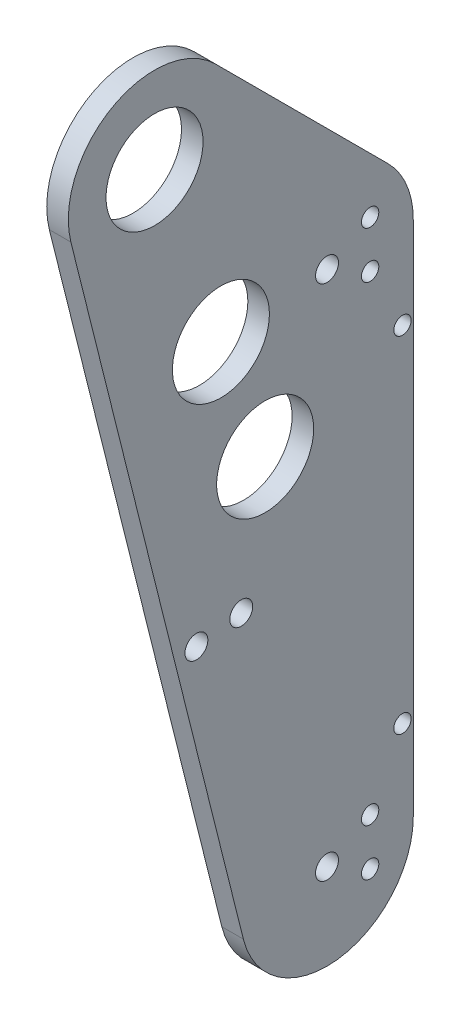
ISO-10303-21;
HEADER;
FILE_DESCRIPTION(('STEP AP214'),'2;1');
FILE_NAME('part.step','',(''),(''),'','','');
FILE_SCHEMA(('AUTOMOTIVE_DESIGN { 1 0 10303 214 1 1 1 1 }'));
ENDSEC;
DATA;
#1=APPLICATION_CONTEXT('core data for automotive mechanical design processes');
#2=APPLICATION_PROTOCOL_DEFINITION('international standard','automotive_design',2000,#1);
#3=PRODUCT_CONTEXT('',#1,'mechanical');
#4=PRODUCT('Part','Part','',(#3));
#5=PRODUCT_RELATED_PRODUCT_CATEGORY('part','',(#4));
#6=PRODUCT_DEFINITION_FORMATION('','',#4);
#7=PRODUCT_DEFINITION_CONTEXT('part definition',#1,'design');
#8=PRODUCT_DEFINITION('design','',#6,#7);
#9=PRODUCT_DEFINITION_SHAPE('','',#8);
#10=(LENGTH_UNIT() NAMED_UNIT(*) SI_UNIT(.MILLI.,.METRE.));
#11=(NAMED_UNIT(*) PLANE_ANGLE_UNIT() SI_UNIT($,.RADIAN.));
#12=(NAMED_UNIT(*) SI_UNIT($,.STERADIAN.) SOLID_ANGLE_UNIT());
#13=UNCERTAINTY_MEASURE_WITH_UNIT(LENGTH_MEASURE(1.E-05),#10,'distance_accuracy_value','');
#14=(GEOMETRIC_REPRESENTATION_CONTEXT(3) GLOBAL_UNCERTAINTY_ASSIGNED_CONTEXT((#13)) GLOBAL_UNIT_ASSIGNED_CONTEXT((#10,
#11,#12)) REPRESENTATION_CONTEXT('',''));
#15=CARTESIAN_POINT('',(0.,0.,0.));
#16=DIRECTION('',(0.,0.,1.));
#17=DIRECTION('',(1.,0.,0.));
#18=AXIS2_PLACEMENT_3D('',#15,#16,#17);
#19=CARTESIAN_POINT('',(6.35,0.,0.));
#20=DIRECTION('',(-1.,0.,0.));
#21=DIRECTION('',(0.,0.,1.));
#22=AXIS2_PLACEMENT_3D('',#19,#20,#21);
#23=CYLINDRICAL_SURFACE('',#22,25.4);
#24=CARTESIAN_POINT('',(0.,0.,0.));
#25=DIRECTION('',(1.,0.,0.));
#26=DIRECTION('',(0.,0.,-1.));
#27=AXIS2_PLACEMENT_3D('',#24,#25,#26);
#28=CIRCLE('',#27,25.4);
#29=CARTESIAN_POINT('',(0.,17.9605122421383,-17.9605122421383));
#30=VERTEX_POINT('',#29);
#31=CARTESIAN_POINT('',(0.,-6.16040487592286,24.6416195036914));
#32=VERTEX_POINT('',#31);
#33=EDGE_CURVE('E122',#30,#32,#28,.T.);
#34=ORIENTED_EDGE('',*,*,#33,.T.);
#35=DIRECTION('',(-1.,0.,0.));
#36=VECTOR('',#35,1.);
#37=CARTESIAN_POINT('',(6.35,-6.16040487592286,24.6416195036914));
#38=LINE('',#37,#36);
#39=CARTESIAN_POINT('',(6.35,-6.16040487592286,24.6416195036914));
#40=VERTEX_POINT('',#39);
#41=EDGE_CURVE('E11',#40,#32,#38,.T.);
#42=ORIENTED_EDGE('',*,*,#41,.F.);
#43=CARTESIAN_POINT('',(6.35,0.,0.));
#44=DIRECTION('',(1.,0.,0.));
#45=DIRECTION('',(0.,0.,-1.));
#46=AXIS2_PLACEMENT_3D('',#43,#44,#45);
#47=CIRCLE('',#46,25.4);
#48=CARTESIAN_POINT('',(6.35,17.9605122421383,-17.9605122421383));
#49=VERTEX_POINT('',#48);
#50=EDGE_CURVE('E133',#49,#40,#47,.T.);
#51=ORIENTED_EDGE('',*,*,#50,.F.);
#52=DIRECTION('',(-1.,0.,0.));
#53=VECTOR('',#52,1.);
#54=CARTESIAN_POINT('',(6.35,17.9605122421383,-17.9605122421383));
#55=LINE('',#54,#53);
#56=EDGE_CURVE('E118',#49,#30,#55,.T.);
#57=ORIENTED_EDGE('',*,*,#56,.T.);
#58=EDGE_LOOP('',(#34,#42,#51,#57));
#59=FACE_BOUND('',#58,.T.);
#60=ADVANCED_FACE('F38',(#59),#23,.T.);
#61=CARTESIAN_POINT('',(6.35,-6.16040487592286,24.6416195036914));
#62=DIRECTION('',(0.,0.242535625036333,-0.970142500145332));
#63=DIRECTION('',(0.,0.970142500145332,0.242535625036333));
#64=AXIS2_PLACEMENT_3D('',#61,#62,#63);
#65=PLANE('',#64);
#66=DIRECTION('',(0.,-0.970142500145332,-0.242535625036333));
#67=VECTOR('',#66,1.);
#68=CARTESIAN_POINT('',(0.,-6.16040487592286,24.6416195036914));
#69=LINE('',#68,#67);
#70=CARTESIAN_POINT('',(0.,-209.360404875923,-26.1583804963086));
#71=VERTEX_POINT('',#70);
#72=EDGE_CURVE('E125',#32,#71,#69,.T.);
#73=ORIENTED_EDGE('',*,*,#72,.T.);
#74=DIRECTION('',(-1.,0.,0.));
#75=VECTOR('',#74,1.);
#76=CARTESIAN_POINT('',(6.35,-209.360404875923,-26.1583804963086));
#77=LINE('',#76,#75);
#78=CARTESIAN_POINT('',(6.35,-209.360404875923,-26.1583804963086));
#79=VERTEX_POINT('',#78);
#80=EDGE_CURVE('E46',#79,#71,#77,.T.);
#81=ORIENTED_EDGE('',*,*,#80,.F.);
#82=DIRECTION('',(0.,-0.970142500145332,-0.242535625036333));
#83=VECTOR('',#82,1.);
#84=CARTESIAN_POINT('',(6.35,-6.16040487592286,24.6416195036914));
#85=LINE('',#84,#83);
#86=EDGE_CURVE('E91',#40,#79,#85,.T.);
#87=ORIENTED_EDGE('',*,*,#86,.F.);
#88=ORIENTED_EDGE('',*,*,#41,.T.);
#89=EDGE_LOOP('',(#73,#81,#87,#88));
#90=FACE_BOUND('',#89,.T.);
#91=ADVANCED_FACE('F158',(#90),#65,.F.);
#92=CARTESIAN_POINT('',(6.35,-203.2,-50.8));
#93=DIRECTION('',(-1.,0.,0.));
#94=DIRECTION('',(0.,0.,1.));
#95=AXIS2_PLACEMENT_3D('',#92,#93,#94);
#96=CYLINDRICAL_SURFACE('',#95,25.4);
#97=CARTESIAN_POINT('',(0.,-203.2,-50.8));
#98=DIRECTION('',(1.,0.,0.));
#99=DIRECTION('',(0.,0.,-1.));
#100=AXIS2_PLACEMENT_3D('',#97,#98,#99);
#101=CIRCLE('',#100,25.4);
#102=CARTESIAN_POINT('',(0.,-203.2,-76.2));
#103=VERTEX_POINT('',#102);
#104=EDGE_CURVE('E128',#71,#103,#101,.T.);
#105=ORIENTED_EDGE('',*,*,#104,.T.);
#106=DIRECTION('',(-1.,0.,0.));
#107=VECTOR('',#106,1.);
#108=CARTESIAN_POINT('',(6.35,-203.2,-76.2));
#109=LINE('',#108,#107);
#110=CARTESIAN_POINT('',(6.35,-203.2,-76.2));
#111=VERTEX_POINT('',#110);
#112=EDGE_CURVE('E113',#111,#103,#109,.T.);
#113=ORIENTED_EDGE('',*,*,#112,.F.);
#114=CARTESIAN_POINT('',(6.35,-203.2,-50.8));
#115=DIRECTION('',(1.,0.,0.));
#116=DIRECTION('',(0.,0.,-1.));
#117=AXIS2_PLACEMENT_3D('',#114,#115,#116);
#118=CIRCLE('',#117,25.4);
#119=EDGE_CURVE('E104',#79,#111,#118,.T.);
#120=ORIENTED_EDGE('',*,*,#119,.F.);
#121=ORIENTED_EDGE('',*,*,#80,.T.);
#122=EDGE_LOOP('',(#105,#113,#120,#121));
#123=FACE_BOUND('',#122,.T.);
#124=ADVANCED_FACE('F139',(#123),#96,.T.);
#125=CARTESIAN_POINT('',(6.35,-203.2,-76.2));
#126=DIRECTION('',(0.,0.,1.));
#127=DIRECTION('',(1.,0.,0.));
#128=AXIS2_PLACEMENT_3D('',#125,#126,#127);
#129=PLANE('',#128);
#130=DIRECTION('',(0.,1.,0.));
#131=VECTOR('',#130,1.);
#132=CARTESIAN_POINT('',(0.,-203.2,-76.2));
#133=LINE('',#132,#131);
#134=CARTESIAN_POINT('',(0.,-50.8,-76.2));
#135=VERTEX_POINT('',#134);
#136=EDGE_CURVE('E112',#103,#135,#133,.T.);
#137=ORIENTED_EDGE('',*,*,#136,.T.);
#138=DIRECTION('',(-1.,0.,0.));
#139=VECTOR('',#138,1.);
#140=CARTESIAN_POINT('',(6.35,-50.8,-76.2));
#141=LINE('',#140,#139);
#142=CARTESIAN_POINT('',(6.35,-50.8,-76.2));
#143=VERTEX_POINT('',#142);
#144=EDGE_CURVE('E109',#143,#135,#141,.T.);
#145=ORIENTED_EDGE('',*,*,#144,.F.);
#146=DIRECTION('',(0.,1.,0.));
#147=VECTOR('',#146,1.);
#148=CARTESIAN_POINT('',(6.35,-203.2,-76.2));
#149=LINE('',#148,#147);
#150=EDGE_CURVE('E98',#111,#143,#149,.T.);
#151=ORIENTED_EDGE('',*,*,#150,.F.);
#152=ORIENTED_EDGE('',*,*,#112,.T.);
#153=EDGE_LOOP('',(#137,#145,#151,#152));
#154=FACE_BOUND('',#153,.T.);
#155=ADVANCED_FACE('F110',(#154),#129,.F.);
#156=CARTESIAN_POINT('',(6.35,-50.8,-50.8));
#157=DIRECTION('',(-1.,0.,0.));
#158=DIRECTION('',(0.,0.,1.));
#159=AXIS2_PLACEMENT_3D('',#156,#157,#158);
#160=CYLINDRICAL_SURFACE('',#159,25.4);
#161=CARTESIAN_POINT('',(0.,-50.8,-50.8));
#162=DIRECTION('',(1.,0.,0.));
#163=DIRECTION('',(0.,0.,-1.));
#164=AXIS2_PLACEMENT_3D('',#161,#162,#163);
#165=CIRCLE('',#164,25.4);
#166=CARTESIAN_POINT('',(0.,-32.8394877578617,-68.7605122421383));
#167=VERTEX_POINT('',#166);
#168=EDGE_CURVE('E77',#135,#167,#165,.T.);
#169=ORIENTED_EDGE('',*,*,#168,.T.);
#170=DIRECTION('',(-1.,0.,0.));
#171=VECTOR('',#170,1.);
#172=CARTESIAN_POINT('',(6.35,-32.8394877578617,-68.7605122421383));
#173=LINE('',#172,#171);
#174=CARTESIAN_POINT('',(6.35,-32.8394877578617,-68.7605122421383));
#175=VERTEX_POINT('',#174);
#176=EDGE_CURVE('E114',#175,#167,#173,.T.);
#177=ORIENTED_EDGE('',*,*,#176,.F.);
#178=CARTESIAN_POINT('',(6.35,-50.8,-50.8));
#179=DIRECTION('',(1.,0.,0.));
#180=DIRECTION('',(0.,0.,-1.));
#181=AXIS2_PLACEMENT_3D('',#178,#179,#180);
#182=CIRCLE('',#181,25.4);
#183=EDGE_CURVE('E102',#143,#175,#182,.T.);
#184=ORIENTED_EDGE('',*,*,#183,.F.);
#185=ORIENTED_EDGE('',*,*,#144,.T.);
#186=EDGE_LOOP('',(#169,#177,#184,#185));
#187=FACE_BOUND('',#186,.T.);
#188=ADVANCED_FACE('F116',(#187),#160,.T.);
#189=CARTESIAN_POINT('',(6.35,-32.8394877578617,-68.7605122421383));
#190=DIRECTION('',(0.,-0.707106781186548,0.707106781186547));
#191=DIRECTION('',(0.,-0.707106781186547,-0.707106781186548));
#192=AXIS2_PLACEMENT_3D('',#189,#190,#191);
#193=PLANE('',#192);
#194=DIRECTION('',(0.,0.707106781186547,0.707106781186548));
#195=VECTOR('',#194,1.);
#196=CARTESIAN_POINT('',(0.,-32.8394877578617,-68.7605122421383));
#197=LINE('',#196,#195);
#198=EDGE_CURVE('E83',#167,#30,#197,.T.);
#199=ORIENTED_EDGE('',*,*,#198,.T.);
#200=ORIENTED_EDGE('',*,*,#56,.F.);
#201=DIRECTION('',(0.,0.707106781186547,0.707106781186548));
#202=VECTOR('',#201,1.);
#203=CARTESIAN_POINT('',(6.35,-32.8394877578617,-68.7605122421383));
#204=LINE('',#203,#202);
#205=EDGE_CURVE('E54',#175,#49,#204,.T.);
#206=ORIENTED_EDGE('',*,*,#205,.F.);
#207=ORIENTED_EDGE('',*,*,#176,.T.);
#208=EDGE_LOOP('',(#199,#200,#206,#207));
#209=FACE_BOUND('',#208,.T.);
#210=ADVANCED_FACE('F146',(#209),#193,.F.);
#211=CARTESIAN_POINT('',(6.35,0.,0.));
#212=DIRECTION('',(1.,0.,0.));
#213=DIRECTION('',(0.,0.,-1.));
#214=AXIS2_PLACEMENT_3D('',#211,#212,#213);
#215=PLANE('',#214);
#216=CARTESIAN_POINT('',(6.34999999999999,-76.2,-73.025));
#217=DIRECTION('',(-1.,0.,0.));
#218=DIRECTION('',(0.,0.,1.));
#219=AXIS2_PLACEMENT_3D('',#216,#217,#218);
#220=CIRCLE('',#219,2.55269999999999);
#221=CARTESIAN_POINT('',(6.34999999999999,-76.2,-70.4723));
#222=VERTEX_POINT('',#221);
#223=EDGE_CURVE('E335',#222,#222,#220,.T.);
#224=ORIENTED_EDGE('',*,*,#223,.T.);
#225=EDGE_LOOP('',(#224));
#226=FACE_BOUND('',#225,.T.);
#227=CARTESIAN_POINT('',(6.34999999999999,-177.8,-73.025));
#228=DIRECTION('',(-1.,0.,0.));
#229=DIRECTION('',(0.,0.,1.));
#230=AXIS2_PLACEMENT_3D('',#227,#228,#229);
#231=CIRCLE('',#230,2.55269999999999);
#232=CARTESIAN_POINT('',(6.34999999999999,-177.8,-70.4723));
#233=VERTEX_POINT('',#232);
#234=EDGE_CURVE('E345',#233,#233,#231,.T.);
#235=ORIENTED_EDGE('',*,*,#234,.T.);
#236=EDGE_LOOP('',(#235));
#237=FACE_BOUND('',#236,.T.);
#238=CARTESIAN_POINT('',(6.34999999999999,-125.856446570165,-25.5354137763876));
#239=DIRECTION('',(-1.,0.,0.));
#240=DIRECTION('',(0.,0.,1.));
#241=AXIS2_PLACEMENT_3D('',#238,#239,#240);
#242=CIRCLE('',#241,3.37819999999998);
#243=CARTESIAN_POINT('',(6.34999999999999,-125.856446570165,-22.1572137763876));
#244=VERTEX_POINT('',#243);
#245=EDGE_CURVE('E351',#244,#244,#242,.T.);
#246=ORIENTED_EDGE('',*,*,#245,.T.);
#247=EDGE_LOOP('',(#246));
#248=FACE_BOUND('',#247,.T.);
#249=CARTESIAN_POINT('',(6.35,-57.7088,-63.5));
#250=DIRECTION('',(-1.,0.,0.));
#251=DIRECTION('',(0.,0.,1.));
#252=AXIS2_PLACEMENT_3D('',#249,#250,#251);
#253=CIRCLE('',#252,2.5527);
#254=CARTESIAN_POINT('',(6.35,-57.7088,-60.9473));
#255=VERTEX_POINT('',#254);
#256=EDGE_CURVE('E357',#255,#255,#253,.T.);
#257=ORIENTED_EDGE('',*,*,#256,.T.);
#258=EDGE_LOOP('',(#257));
#259=FACE_BOUND('',#258,.T.);
#260=CARTESIAN_POINT('',(6.35,-43.8912,-63.5));
#261=DIRECTION('',(-1.,0.,0.));
#262=DIRECTION('',(0.,0.,1.));
#263=AXIS2_PLACEMENT_3D('',#260,#261,#262);
#264=CIRCLE('',#263,2.5527);
#265=CARTESIAN_POINT('',(6.35,-43.8912,-60.9473));
#266=VERTEX_POINT('',#265);
#267=EDGE_CURVE('E363',#266,#266,#264,.T.);
#268=ORIENTED_EDGE('',*,*,#267,.T.);
#269=EDGE_LOOP('',(#268));
#270=FACE_BOUND('',#269,.T.);
#271=CARTESIAN_POINT('',(6.35,-210.1088,-63.5));
#272=DIRECTION('',(-1.,0.,0.));
#273=DIRECTION('',(0.,0.,1.));
#274=AXIS2_PLACEMENT_3D('',#271,#272,#273);
#275=CIRCLE('',#274,2.55269999999999);
#276=CARTESIAN_POINT('',(6.35,-210.1088,-60.9473));
#277=VERTEX_POINT('',#276);
#278=EDGE_CURVE('E369',#277,#277,#275,.T.);
#279=ORIENTED_EDGE('',*,*,#278,.T.);
#280=EDGE_LOOP('',(#279));
#281=FACE_BOUND('',#280,.T.);
#282=CARTESIAN_POINT('',(6.35,-196.2912,-63.5));
#283=DIRECTION('',(-1.,0.,0.));
#284=DIRECTION('',(0.,0.,1.));
#285=AXIS2_PLACEMENT_3D('',#282,#283,#284);
#286=CIRCLE('',#285,2.55269999999999);
#287=CARTESIAN_POINT('',(6.35,-196.2912,-60.9473));
#288=VERTEX_POINT('',#287);
#289=EDGE_CURVE('E375',#288,#288,#286,.T.);
#290=ORIENTED_EDGE('',*,*,#289,.T.);
#291=EDGE_LOOP('',(#290));
#292=FACE_BOUND('',#291,.T.);
#293=CARTESIAN_POINT('',(6.35,-50.8,-50.8));
#294=DIRECTION('',(1.,0.,0.));
#295=DIRECTION('',(0.,0.,-1.));
#296=AXIS2_PLACEMENT_3D('',#293,#294,#295);
#297=CIRCLE('',#296,3.37819999999998);
#298=CARTESIAN_POINT('',(6.35,-50.8,-54.1782));
#299=VERTEX_POINT('',#298);
#300=EDGE_CURVE('E378',#299,#299,#297,.T.);
#301=ORIENTED_EDGE('',*,*,#300,.F.);
#302=EDGE_LOOP('',(#301));
#303=FACE_BOUND('',#302,.T.);
#304=CARTESIAN_POINT('',(6.35,-203.2,-50.8));
#305=DIRECTION('',(1.,0.,0.));
#306=DIRECTION('',(0.,0.,-1.));
#307=AXIS2_PLACEMENT_3D('',#304,#305,#306);
#308=CIRCLE('',#307,3.3782);
#309=CARTESIAN_POINT('',(6.35,-203.2,-54.1782));
#310=VERTEX_POINT('',#309);
#311=EDGE_CURVE('E384',#310,#310,#308,.T.);
#312=ORIENTED_EDGE('',*,*,#311,.F.);
#313=EDGE_LOOP('',(#312));
#314=FACE_BOUND('',#313,.T.);
#315=CARTESIAN_POINT('',(6.35,-127.828401175399,-12.3208097518457));
#316=DIRECTION('',(1.,0.,0.));
#317=DIRECTION('',(0.,0.,-1.));
#318=AXIS2_PLACEMENT_3D('',#315,#316,#317);
#319=CIRCLE('',#318,3.37819999999998);
#320=CARTESIAN_POINT('',(6.35,-127.828401175399,-15.6990097518457));
#321=VERTEX_POINT('',#320);
#322=EDGE_CURVE('E390',#321,#321,#319,.T.);
#323=ORIENTED_EDGE('',*,*,#322,.F.);
#324=EDGE_LOOP('',(#323));
#325=FACE_BOUND('',#324,.T.);
#326=CARTESIAN_POINT('',(6.35,0.,0.));
#327=DIRECTION('',(1.,0.,0.));
#328=DIRECTION('',(0.,0.,-1.));
#329=AXIS2_PLACEMENT_3D('',#326,#327,#328);
#330=CIRCLE('',#329,14.2875);
#331=CARTESIAN_POINT('',(6.35,0.,-14.2875));
#332=VERTEX_POINT('',#331);
#333=EDGE_CURVE('E396',#332,#332,#330,.T.);
#334=ORIENTED_EDGE('',*,*,#333,.F.);
#335=EDGE_LOOP('',(#334));
#336=FACE_BOUND('',#335,.T.);
#337=CARTESIAN_POINT('',(6.35,-53.7034332779148,-19.5464511910616));
#338=DIRECTION('',(1.,0.,0.));
#339=DIRECTION('',(0.,0.,-1.));
#340=AXIS2_PLACEMENT_3D('',#337,#338,#339);
#341=CIRCLE('',#340,14.2875);
#342=CARTESIAN_POINT('',(6.35,-53.7034332779148,-33.8339511910616));
#343=VERTEX_POINT('',#342);
#344=EDGE_CURVE('E402',#343,#343,#341,.T.);
#345=ORIENTED_EDGE('',*,*,#344,.F.);
#346=EDGE_LOOP('',(#345));
#347=FACE_BOUND('',#346,.T.);
#348=CARTESIAN_POINT('',(6.35,-89.505722129858,-32.5774186517694));
#349=DIRECTION('',(1.,0.,0.));
#350=DIRECTION('',(0.,0.,-1.));
#351=AXIS2_PLACEMENT_3D('',#348,#349,#350);
#352=CIRCLE('',#351,14.2875);
#353=CARTESIAN_POINT('',(6.35,-89.505722129858,-46.8649186517694));
#354=VERTEX_POINT('',#353);
#355=EDGE_CURVE('E408',#354,#354,#352,.T.);
#356=ORIENTED_EDGE('',*,*,#355,.F.);
#357=EDGE_LOOP('',(#356));
#358=FACE_BOUND('',#357,.T.);
#359=ORIENTED_EDGE('',*,*,#50,.T.);
#360=ORIENTED_EDGE('',*,*,#86,.T.);
#361=ORIENTED_EDGE('',*,*,#119,.T.);
#362=ORIENTED_EDGE('',*,*,#150,.T.);
#363=ORIENTED_EDGE('',*,*,#183,.T.);
#364=ORIENTED_EDGE('',*,*,#205,.T.);
#365=EDGE_LOOP('',(#359,#360,#361,#362,#363,#364));
#366=FACE_BOUND('',#365,.T.);
#367=ADVANCED_FACE('F100',(#226,#237,#248,#259,#270,#281,#292,#303,#314,#325,#336,#347,#358,
#366),#215,.T.);
#368=CARTESIAN_POINT('',(0.,0.,0.));
#369=DIRECTION('',(1.,0.,0.));
#370=DIRECTION('',(0.,0.,-1.));
#371=AXIS2_PLACEMENT_3D('',#368,#369,#370);
#372=PLANE('',#371);
#373=CARTESIAN_POINT('',(0.,-76.2,-73.025));
#374=DIRECTION('',(-1.,0.,0.));
#375=DIRECTION('',(0.,0.,1.));
#376=AXIS2_PLACEMENT_3D('',#373,#374,#375);
#377=CIRCLE('',#376,2.55269999999999);
#378=CARTESIAN_POINT('',(0.,-76.2,-70.4723));
#379=VERTEX_POINT('',#378);
#380=EDGE_CURVE('E338',#379,#379,#377,.T.);
#381=ORIENTED_EDGE('',*,*,#380,.F.);
#382=EDGE_LOOP('',(#381));
#383=FACE_BOUND('',#382,.T.);
#384=CARTESIAN_POINT('',(0.,-177.8,-73.025));
#385=DIRECTION('',(-1.,0.,0.));
#386=DIRECTION('',(0.,0.,1.));
#387=AXIS2_PLACEMENT_3D('',#384,#385,#386);
#388=CIRCLE('',#387,2.55269999999999);
#389=CARTESIAN_POINT('',(0.,-177.8,-70.4723));
#390=VERTEX_POINT('',#389);
#391=EDGE_CURVE('E340',#390,#390,#388,.T.);
#392=ORIENTED_EDGE('',*,*,#391,.F.);
#393=EDGE_LOOP('',(#392));
#394=FACE_BOUND('',#393,.T.);
#395=CARTESIAN_POINT('',(0.,-125.856446570165,-25.5354137763876));
#396=DIRECTION('',(-1.,0.,0.));
#397=DIRECTION('',(0.,0.,1.));
#398=AXIS2_PLACEMENT_3D('',#395,#396,#397);
#399=CIRCLE('',#398,3.37819999999998);
#400=CARTESIAN_POINT('',(0.,-125.856446570165,-22.1572137763876));
#401=VERTEX_POINT('',#400);
#402=EDGE_CURVE('E348',#401,#401,#399,.T.);
#403=ORIENTED_EDGE('',*,*,#402,.F.);
#404=EDGE_LOOP('',(#403));
#405=FACE_BOUND('',#404,.T.);
#406=CARTESIAN_POINT('',(0.,-57.7088,-63.5));
#407=DIRECTION('',(-1.,0.,0.));
#408=DIRECTION('',(0.,0.,1.));
#409=AXIS2_PLACEMENT_3D('',#406,#407,#408);
#410=CIRCLE('',#409,2.5527);
#411=CARTESIAN_POINT('',(0.,-57.7088,-60.9473));
#412=VERTEX_POINT('',#411);
#413=EDGE_CURVE('E354',#412,#412,#410,.T.);
#414=ORIENTED_EDGE('',*,*,#413,.F.);
#415=EDGE_LOOP('',(#414));
#416=FACE_BOUND('',#415,.T.);
#417=CARTESIAN_POINT('',(0.,-43.8912,-63.5));
#418=DIRECTION('',(-1.,0.,0.));
#419=DIRECTION('',(0.,0.,1.));
#420=AXIS2_PLACEMENT_3D('',#417,#418,#419);
#421=CIRCLE('',#420,2.5527);
#422=CARTESIAN_POINT('',(0.,-43.8912,-60.9473));
#423=VERTEX_POINT('',#422);
#424=EDGE_CURVE('E360',#423,#423,#421,.T.);
#425=ORIENTED_EDGE('',*,*,#424,.F.);
#426=EDGE_LOOP('',(#425));
#427=FACE_BOUND('',#426,.T.);
#428=CARTESIAN_POINT('',(0.,-210.1088,-63.5));
#429=DIRECTION('',(-1.,0.,0.));
#430=DIRECTION('',(0.,0.,1.));
#431=AXIS2_PLACEMENT_3D('',#428,#429,#430);
#432=CIRCLE('',#431,2.55269999999999);
#433=CARTESIAN_POINT('',(0.,-210.1088,-60.9473));
#434=VERTEX_POINT('',#433);
#435=EDGE_CURVE('E366',#434,#434,#432,.T.);
#436=ORIENTED_EDGE('',*,*,#435,.F.);
#437=EDGE_LOOP('',(#436));
#438=FACE_BOUND('',#437,.T.);
#439=CARTESIAN_POINT('',(0.,-196.2912,-63.5));
#440=DIRECTION('',(-1.,0.,0.));
#441=DIRECTION('',(0.,0.,1.));
#442=AXIS2_PLACEMENT_3D('',#439,#440,#441);
#443=CIRCLE('',#442,2.55269999999999);
#444=CARTESIAN_POINT('',(0.,-196.2912,-60.9473));
#445=VERTEX_POINT('',#444);
#446=EDGE_CURVE('E372',#445,#445,#443,.T.);
#447=ORIENTED_EDGE('',*,*,#446,.F.);
#448=EDGE_LOOP('',(#447));
#449=FACE_BOUND('',#448,.T.);
#450=CARTESIAN_POINT('',(0.,-50.8,-50.8));
#451=DIRECTION('',(1.,0.,0.));
#452=DIRECTION('',(0.,0.,-1.));
#453=AXIS2_PLACEMENT_3D('',#450,#451,#452);
#454=CIRCLE('',#453,3.3782);
#455=CARTESIAN_POINT('',(0.,-50.8,-54.1782));
#456=VERTEX_POINT('',#455);
#457=EDGE_CURVE('E381',#456,#456,#454,.T.);
#458=ORIENTED_EDGE('',*,*,#457,.T.);
#459=EDGE_LOOP('',(#458));
#460=FACE_BOUND('',#459,.T.);
#461=CARTESIAN_POINT('',(0.,-203.2,-50.8));
#462=DIRECTION('',(1.,0.,0.));
#463=DIRECTION('',(0.,0.,-1.));
#464=AXIS2_PLACEMENT_3D('',#461,#462,#463);
#465=CIRCLE('',#464,3.3782);
#466=CARTESIAN_POINT('',(0.,-203.2,-54.1782));
#467=VERTEX_POINT('',#466);
#468=EDGE_CURVE('E387',#467,#467,#465,.T.);
#469=ORIENTED_EDGE('',*,*,#468,.T.);
#470=EDGE_LOOP('',(#469));
#471=FACE_BOUND('',#470,.T.);
#472=CARTESIAN_POINT('',(0.,-127.828401175399,-12.3208097518457));
#473=DIRECTION('',(1.,0.,0.));
#474=DIRECTION('',(0.,0.,-1.));
#475=AXIS2_PLACEMENT_3D('',#472,#473,#474);
#476=CIRCLE('',#475,3.3782);
#477=CARTESIAN_POINT('',(0.,-127.828401175399,-15.6990097518457));
#478=VERTEX_POINT('',#477);
#479=EDGE_CURVE('E393',#478,#478,#476,.T.);
#480=ORIENTED_EDGE('',*,*,#479,.T.);
#481=EDGE_LOOP('',(#480));
#482=FACE_BOUND('',#481,.T.);
#483=CARTESIAN_POINT('',(0.,0.,0.));
#484=DIRECTION('',(1.,0.,0.));
#485=DIRECTION('',(0.,0.,-1.));
#486=AXIS2_PLACEMENT_3D('',#483,#484,#485);
#487=CIRCLE('',#486,14.2875);
#488=CARTESIAN_POINT('',(0.,0.,-14.2875));
#489=VERTEX_POINT('',#488);
#490=EDGE_CURVE('E399',#489,#489,#487,.T.);
#491=ORIENTED_EDGE('',*,*,#490,.T.);
#492=EDGE_LOOP('',(#491));
#493=FACE_BOUND('',#492,.T.);
#494=CARTESIAN_POINT('',(0.,-53.7034332779148,-19.5464511910616));
#495=DIRECTION('',(1.,0.,0.));
#496=DIRECTION('',(0.,0.,-1.));
#497=AXIS2_PLACEMENT_3D('',#494,#495,#496);
#498=CIRCLE('',#497,14.2875);
#499=CARTESIAN_POINT('',(0.,-53.7034332779148,-33.8339511910616));
#500=VERTEX_POINT('',#499);
#501=EDGE_CURVE('E405',#500,#500,#498,.T.);
#502=ORIENTED_EDGE('',*,*,#501,.T.);
#503=EDGE_LOOP('',(#502));
#504=FACE_BOUND('',#503,.T.);
#505=CARTESIAN_POINT('',(0.,-89.505722129858,-32.5774186517694));
#506=DIRECTION('',(1.,0.,0.));
#507=DIRECTION('',(0.,0.,-1.));
#508=AXIS2_PLACEMENT_3D('',#505,#506,#507);
#509=CIRCLE('',#508,14.2875);
#510=CARTESIAN_POINT('',(0.,-89.505722129858,-46.8649186517694));
#511=VERTEX_POINT('',#510);
#512=EDGE_CURVE('E126',#511,#511,#509,.T.);
#513=ORIENTED_EDGE('',*,*,#512,.T.);
#514=EDGE_LOOP('',(#513));
#515=FACE_BOUND('',#514,.T.);
#516=ORIENTED_EDGE('',*,*,#33,.F.);
#517=ORIENTED_EDGE('',*,*,#198,.F.);
#518=ORIENTED_EDGE('',*,*,#168,.F.);
#519=ORIENTED_EDGE('',*,*,#136,.F.);
#520=ORIENTED_EDGE('',*,*,#104,.F.);
#521=ORIENTED_EDGE('',*,*,#72,.F.);
#522=EDGE_LOOP('',(#516,#517,#518,#519,#520,#521));
#523=FACE_BOUND('',#522,.T.);
#524=ADVANCED_FACE('F142',(#383,#394,#405,#416,#427,#438,#449,#460,#471,#482,#493,#504,#515,
#523),#372,.F.);
#525=CARTESIAN_POINT('',(6.35,-89.505722129858,-32.5774186517694));
#526=DIRECTION('',(1.,0.,0.));
#527=DIRECTION('',(0.,0.,-1.));
#528=AXIS2_PLACEMENT_3D('',#525,#526,#527);
#529=CYLINDRICAL_SURFACE('',#528,14.2875);
#530=ORIENTED_EDGE('',*,*,#512,.F.);
#531=EDGE_LOOP('',(#530));
#532=FACE_BOUND('',#531,.T.);
#533=ORIENTED_EDGE('',*,*,#355,.T.);
#534=EDGE_LOOP('',(#533));
#535=FACE_BOUND('',#534,.T.);
#536=ADVANCED_FACE('F186',(#532,#535),#529,.F.);
#537=CARTESIAN_POINT('',(6.35,-53.7034332779148,-19.5464511910616));
#538=DIRECTION('',(1.,0.,0.));
#539=DIRECTION('',(0.,0.,-1.));
#540=AXIS2_PLACEMENT_3D('',#537,#538,#539);
#541=CYLINDRICAL_SURFACE('',#540,14.2875);
#542=ORIENTED_EDGE('',*,*,#501,.F.);
#543=EDGE_LOOP('',(#542));
#544=FACE_BOUND('',#543,.T.);
#545=ORIENTED_EDGE('',*,*,#344,.T.);
#546=EDGE_LOOP('',(#545));
#547=FACE_BOUND('',#546,.T.);
#548=ADVANCED_FACE('F191',(#544,#547),#541,.F.);
#549=CARTESIAN_POINT('',(6.35,0.,0.));
#550=DIRECTION('',(1.,0.,0.));
#551=DIRECTION('',(0.,0.,-1.));
#552=AXIS2_PLACEMENT_3D('',#549,#550,#551);
#553=CYLINDRICAL_SURFACE('',#552,14.2875);
#554=ORIENTED_EDGE('',*,*,#490,.F.);
#555=EDGE_LOOP('',(#554));
#556=FACE_BOUND('',#555,.T.);
#557=ORIENTED_EDGE('',*,*,#333,.T.);
#558=EDGE_LOOP('',(#557));
#559=FACE_BOUND('',#558,.T.);
#560=ADVANCED_FACE('F203',(#556,#559),#553,.F.);
#561=CARTESIAN_POINT('',(6.35,-127.828401175399,-12.3208097518457));
#562=DIRECTION('',(1.,0.,0.));
#563=DIRECTION('',(0.,0.,-1.));
#564=AXIS2_PLACEMENT_3D('',#561,#562,#563);
#565=CYLINDRICAL_SURFACE('',#564,3.37819999999999);
#566=ORIENTED_EDGE('',*,*,#479,.F.);
#567=EDGE_LOOP('',(#566));
#568=FACE_BOUND('',#567,.T.);
#569=ORIENTED_EDGE('',*,*,#322,.T.);
#570=EDGE_LOOP('',(#569));
#571=FACE_BOUND('',#570,.T.);
#572=ADVANCED_FACE('F213',(#568,#571),#565,.F.);
#573=CARTESIAN_POINT('',(6.35,-203.2,-50.8));
#574=DIRECTION('',(1.,0.,0.));
#575=DIRECTION('',(0.,0.,-1.));
#576=AXIS2_PLACEMENT_3D('',#573,#574,#575);
#577=CYLINDRICAL_SURFACE('',#576,3.3782);
#578=ORIENTED_EDGE('',*,*,#468,.F.);
#579=EDGE_LOOP('',(#578));
#580=FACE_BOUND('',#579,.T.);
#581=ORIENTED_EDGE('',*,*,#311,.T.);
#582=EDGE_LOOP('',(#581));
#583=FACE_BOUND('',#582,.T.);
#584=ADVANCED_FACE('F223',(#580,#583),#577,.F.);
#585=CARTESIAN_POINT('',(6.35,-50.8,-50.8));
#586=DIRECTION('',(1.,0.,0.));
#587=DIRECTION('',(0.,0.,-1.));
#588=AXIS2_PLACEMENT_3D('',#585,#586,#587);
#589=CYLINDRICAL_SURFACE('',#588,3.37819999999999);
#590=ORIENTED_EDGE('',*,*,#457,.F.);
#591=EDGE_LOOP('',(#590));
#592=FACE_BOUND('',#591,.T.);
#593=ORIENTED_EDGE('',*,*,#300,.T.);
#594=EDGE_LOOP('',(#593));
#595=FACE_BOUND('',#594,.T.);
#596=ADVANCED_FACE('F233',(#592,#595),#589,.F.);
#597=CARTESIAN_POINT('',(0.,-196.2912,-63.5));
#598=DIRECTION('',(-1.,0.,0.));
#599=DIRECTION('',(0.,0.,1.));
#600=AXIS2_PLACEMENT_3D('',#597,#598,#599);
#601=CYLINDRICAL_SURFACE('',#600,2.55269999999999);
#602=ORIENTED_EDGE('',*,*,#289,.F.);
#603=EDGE_LOOP('',(#602));
#604=FACE_BOUND('',#603,.T.);
#605=ORIENTED_EDGE('',*,*,#446,.T.);
#606=EDGE_LOOP('',(#605));
#607=FACE_BOUND('',#606,.T.);
#608=ADVANCED_FACE('F243',(#604,#607),#601,.F.);
#609=CARTESIAN_POINT('',(0.,-210.1088,-63.5));
#610=DIRECTION('',(-1.,0.,0.));
#611=DIRECTION('',(0.,0.,1.));
#612=AXIS2_PLACEMENT_3D('',#609,#610,#611);
#613=CYLINDRICAL_SURFACE('',#612,2.55269999999999);
#614=ORIENTED_EDGE('',*,*,#278,.F.);
#615=EDGE_LOOP('',(#614));
#616=FACE_BOUND('',#615,.T.);
#617=ORIENTED_EDGE('',*,*,#435,.T.);
#618=EDGE_LOOP('',(#617));
#619=FACE_BOUND('',#618,.T.);
#620=ADVANCED_FACE('F254',(#616,#619),#613,.F.);
#621=CARTESIAN_POINT('',(0.,-43.8912,-63.5));
#622=DIRECTION('',(-1.,0.,0.));
#623=DIRECTION('',(0.,0.,1.));
#624=AXIS2_PLACEMENT_3D('',#621,#622,#623);
#625=CYLINDRICAL_SURFACE('',#624,2.5527);
#626=ORIENTED_EDGE('',*,*,#267,.F.);
#627=EDGE_LOOP('',(#626));
#628=FACE_BOUND('',#627,.T.);
#629=ORIENTED_EDGE('',*,*,#424,.T.);
#630=EDGE_LOOP('',(#629));
#631=FACE_BOUND('',#630,.T.);
#632=ADVANCED_FACE('F265',(#628,#631),#625,.F.);
#633=CARTESIAN_POINT('',(0.,-57.7088,-63.5));
#634=DIRECTION('',(-1.,0.,0.));
#635=DIRECTION('',(0.,0.,1.));
#636=AXIS2_PLACEMENT_3D('',#633,#634,#635);
#637=CYLINDRICAL_SURFACE('',#636,2.5527);
#638=ORIENTED_EDGE('',*,*,#256,.F.);
#639=EDGE_LOOP('',(#638));
#640=FACE_BOUND('',#639,.T.);
#641=ORIENTED_EDGE('',*,*,#413,.T.);
#642=EDGE_LOOP('',(#641));
#643=FACE_BOUND('',#642,.T.);
#644=ADVANCED_FACE('F276',(#640,#643),#637,.F.);
#645=CARTESIAN_POINT('',(0.,-125.856446570165,-25.5354137763876));
#646=DIRECTION('',(-1.,0.,0.));
#647=DIRECTION('',(0.,0.,1.));
#648=AXIS2_PLACEMENT_3D('',#645,#646,#647);
#649=CYLINDRICAL_SURFACE('',#648,3.37819999999998);
#650=ORIENTED_EDGE('',*,*,#245,.F.);
#651=EDGE_LOOP('',(#650));
#652=FACE_BOUND('',#651,.T.);
#653=ORIENTED_EDGE('',*,*,#402,.T.);
#654=EDGE_LOOP('',(#653));
#655=FACE_BOUND('',#654,.T.);
#656=ADVANCED_FACE('F287',(#652,#655),#649,.F.);
#657=CARTESIAN_POINT('',(0.,-177.8,-73.025));
#658=DIRECTION('',(-1.,0.,0.));
#659=DIRECTION('',(0.,0.,1.));
#660=AXIS2_PLACEMENT_3D('',#657,#658,#659);
#661=CYLINDRICAL_SURFACE('',#660,2.55269999999999);
#662=ORIENTED_EDGE('',*,*,#234,.F.);
#663=EDGE_LOOP('',(#662));
#664=FACE_BOUND('',#663,.T.);
#665=ORIENTED_EDGE('',*,*,#391,.T.);
#666=EDGE_LOOP('',(#665));
#667=FACE_BOUND('',#666,.T.);
#668=ADVANCED_FACE('F297',(#664,#667),#661,.F.);
#669=CARTESIAN_POINT('',(0.,-76.2,-73.025));
#670=DIRECTION('',(-1.,0.,0.));
#671=DIRECTION('',(0.,0.,1.));
#672=AXIS2_PLACEMENT_3D('',#669,#670,#671);
#673=CYLINDRICAL_SURFACE('',#672,2.55269999999999);
#674=ORIENTED_EDGE('',*,*,#223,.F.);
#675=EDGE_LOOP('',(#674));
#676=FACE_BOUND('',#675,.T.);
#677=ORIENTED_EDGE('',*,*,#380,.T.);
#678=EDGE_LOOP('',(#677));
#679=FACE_BOUND('',#678,.T.);
#680=ADVANCED_FACE('F318',(#676,#679),#673,.F.);
#681=CLOSED_SHELL('',(#60,#91,#124,#155,#188,#210,#367,#524,#536,#548,#560,#572,#584,#596,#608,
#620,#632,#644,#656,#668,#680));
#682=MANIFOLD_SOLID_BREP('B2',#681);
#683=ADVANCED_BREP_SHAPE_REPRESENTATION('',(#18,#682),#14);
#684=SHAPE_DEFINITION_REPRESENTATION(#9,#683);
ENDSEC;
END-ISO-10303-21;
